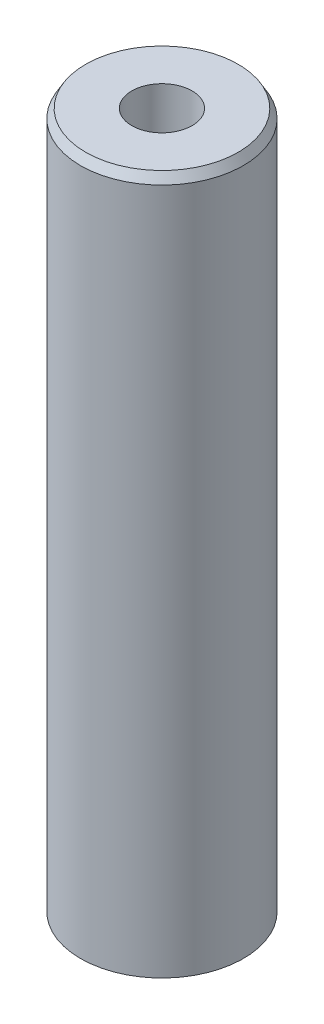
ISO-10303-21;
HEADER;
FILE_DESCRIPTION(('STEP AP214'),'2;1');
FILE_NAME('part.step','',(''),(''),'','','');
FILE_SCHEMA(('AUTOMOTIVE_DESIGN { 1 0 10303 214 1 1 1 1 }'));
ENDSEC;
DATA;
#1=APPLICATION_CONTEXT('core data for automotive mechanical design processes');
#2=APPLICATION_PROTOCOL_DEFINITION('international standard','automotive_design',2000,#1);
#3=PRODUCT_CONTEXT('',#1,'mechanical');
#4=PRODUCT('Part','Part','',(#3));
#5=PRODUCT_RELATED_PRODUCT_CATEGORY('part','',(#4));
#6=PRODUCT_DEFINITION_FORMATION('','',#4);
#7=PRODUCT_DEFINITION_CONTEXT('part definition',#1,'design');
#8=PRODUCT_DEFINITION('design','',#6,#7);
#9=PRODUCT_DEFINITION_SHAPE('','',#8);
#10=(LENGTH_UNIT() NAMED_UNIT(*) SI_UNIT(.MILLI.,.METRE.));
#11=(NAMED_UNIT(*) PLANE_ANGLE_UNIT() SI_UNIT($,.RADIAN.));
#12=(NAMED_UNIT(*) SI_UNIT($,.STERADIAN.) SOLID_ANGLE_UNIT());
#13=UNCERTAINTY_MEASURE_WITH_UNIT(LENGTH_MEASURE(1.E-05),#10,'distance_accuracy_value','');
#14=(GEOMETRIC_REPRESENTATION_CONTEXT(3) GLOBAL_UNCERTAINTY_ASSIGNED_CONTEXT((#13)) GLOBAL_UNIT_ASSIGNED_CONTEXT((#10,
#11,#12)) REPRESENTATION_CONTEXT('',''));
#15=CARTESIAN_POINT('',(0.,0.,0.));
#16=DIRECTION('',(0.,0.,1.));
#17=DIRECTION('',(1.,0.,0.));
#18=AXIS2_PLACEMENT_3D('',#15,#16,#17);
#19=CARTESIAN_POINT('',(0.,236.650991443495,0.));
#20=DIRECTION('',(0.,-1.,0.));
#21=DIRECTION('',(0.,0.,-1.));
#22=AXIS2_PLACEMENT_3D('',#19,#20,#21);
#23=CYLINDRICAL_SURFACE('',#22,27.5);
#24=CARTESIAN_POINT('',(0.,233.628504235652,0.));
#25=DIRECTION('',(0.,1.,0.));
#26=DIRECTION('',(0.,0.,1.));
#27=AXIS2_PLACEMENT_3D('',#24,#25,#26);
#28=CIRCLE('',#27,27.5);
#29=CARTESIAN_POINT('',(0.,233.628504235652,27.5));
#30=VERTEX_POINT('',#29);
#31=EDGE_CURVE('E50',#30,#30,#28,.F.);
#32=ORIENTED_EDGE('',*,*,#31,.T.);
#33=EDGE_LOOP('',(#32));
#34=FACE_BOUND('',#33,.T.);
#35=CARTESIAN_POINT('',(0.,1.74503380307023,0.));
#36=DIRECTION('',(0.,1.,0.));
#37=DIRECTION('',(0.,0.,1.));
#38=AXIS2_PLACEMENT_3D('',#35,#36,#37);
#39=CIRCLE('',#38,27.5);
#40=CARTESIAN_POINT('',(0.,1.74503380307023,27.5));
#41=VERTEX_POINT('',#40);
#42=EDGE_CURVE('E51',#41,#41,#39,.T.);
#43=ORIENTED_EDGE('',*,*,#42,.T.);
#44=EDGE_LOOP('',(#43));
#45=FACE_BOUND('',#44,.T.);
#46=ADVANCED_FACE('F39',(#34,#45),#23,.T.);
#47=CARTESIAN_POINT('',(0.,236.650991443495,0.));
#48=DIRECTION('',(0.,1.,0.));
#49=DIRECTION('',(0.,0.,1.));
#50=AXIS2_PLACEMENT_3D('',#47,#48,#49);
#51=PLANE('',#50);
#52=CARTESIAN_POINT('',(0.,236.650991443495,0.));
#53=DIRECTION('',(0.,1.,0.));
#54=DIRECTION('',(0.,0.,1.));
#55=AXIS2_PLACEMENT_3D('',#52,#53,#54);
#56=CIRCLE('',#55,25.7549661969298);
#57=CARTESIAN_POINT('',(0.,236.650991443495,25.7549661969298));
#58=VERTEX_POINT('',#57);
#59=EDGE_CURVE('E54',#58,#58,#56,.T.);
#60=ORIENTED_EDGE('',*,*,#59,.T.);
#61=EDGE_LOOP('',(#60));
#62=FACE_BOUND('',#61,.T.);
#63=CARTESIAN_POINT('',(0.,236.650991443495,0.));
#64=DIRECTION('',(0.,1.,0.));
#65=DIRECTION('',(0.,0.,1.));
#66=AXIS2_PLACEMENT_3D('',#63,#64,#65);
#67=CIRCLE('',#66,10.1835658193665);
#68=CARTESIAN_POINT('',(0.,236.650991443495,10.1835658193665));
#69=VERTEX_POINT('',#68);
#70=EDGE_CURVE('E58',#69,#69,#67,.T.);
#71=ORIENTED_EDGE('',*,*,#70,.F.);
#72=EDGE_LOOP('',(#71));
#73=FACE_BOUND('',#72,.T.);
#74=ADVANCED_FACE('F69',(#62,#73),#51,.T.);
#75=CARTESIAN_POINT('',(0.,0.,0.));
#76=DIRECTION('',(0.,1.,0.));
#77=DIRECTION('',(0.,0.,1.));
#78=AXIS2_PLACEMENT_3D('',#75,#76,#77);
#79=PLANE('',#78);
#80=CARTESIAN_POINT('',(0.,0.,0.));
#81=DIRECTION('',(0.,1.,0.));
#82=DIRECTION('',(0.,0.,1.));
#83=AXIS2_PLACEMENT_3D('',#80,#81,#82);
#84=CIRCLE('',#83,24.4775127921572);
#85=CARTESIAN_POINT('',(0.,0.,24.4775127921572));
#86=VERTEX_POINT('',#85);
#87=EDGE_CURVE('E10',#86,#86,#84,.F.);
#88=ORIENTED_EDGE('',*,*,#87,.T.);
#89=EDGE_LOOP('',(#88));
#90=FACE_BOUND('',#89,.T.);
#91=CARTESIAN_POINT('',(0.,0.,0.));
#92=DIRECTION('',(0.,1.,0.));
#93=DIRECTION('',(0.,0.,1.));
#94=AXIS2_PLACEMENT_3D('',#91,#92,#93);
#95=CIRCLE('',#94,10.1835658193665);
#96=CARTESIAN_POINT('',(0.,0.,10.1835658193665));
#97=VERTEX_POINT('',#96);
#98=EDGE_CURVE('E63',#97,#97,#95,.T.);
#99=ORIENTED_EDGE('',*,*,#98,.T.);
#100=EDGE_LOOP('',(#99));
#101=FACE_BOUND('',#100,.T.);
#102=ADVANCED_FACE('F75',(#90,#101),#79,.F.);
#103=CARTESIAN_POINT('',(0.,236.650991443495,0.));
#104=DIRECTION('',(0.,-1.,0.));
#105=DIRECTION('',(0.,0.,-1.));
#106=AXIS2_PLACEMENT_3D('',#103,#104,#105);
#107=CYLINDRICAL_SURFACE('',#106,10.1835658193665);
#108=ORIENTED_EDGE('',*,*,#70,.T.);
#109=EDGE_LOOP('',(#108));
#110=FACE_BOUND('',#109,.T.);
#111=ORIENTED_EDGE('',*,*,#98,.F.);
#112=EDGE_LOOP('',(#111));
#113=FACE_BOUND('',#112,.T.);
#114=ADVANCED_FACE('F70',(#110,#113),#107,.F.);
#115=CARTESIAN_POINT('',(0.,236.650991443495,0.));
#116=DIRECTION('',(0.,-1.,0.));
#117=DIRECTION('',(0.,0.,-1.));
#118=AXIS2_PLACEMENT_3D('',#115,#116,#117);
#119=CONICAL_SURFACE('',#118,25.7549661969298,0.523598775598296);
#120=ORIENTED_EDGE('',*,*,#31,.F.);
#121=EDGE_LOOP('',(#120));
#122=FACE_BOUND('',#121,.T.);
#123=ORIENTED_EDGE('',*,*,#59,.F.);
#124=EDGE_LOOP('',(#123));
#125=FACE_BOUND('',#124,.T.);
#126=ADVANCED_FACE('F81',(#122,#125),#119,.T.);
#127=CARTESIAN_POINT('',(0.,1.74503380307023,0.));
#128=DIRECTION('',(0.,1.,0.));
#129=DIRECTION('',(0.,0.,1.));
#130=AXIS2_PLACEMENT_3D('',#127,#128,#129);
#131=CONICAL_SURFACE('',#130,27.5,1.0471975511966);
#132=ORIENTED_EDGE('',*,*,#87,.F.);
#133=EDGE_LOOP('',(#132));
#134=FACE_BOUND('',#133,.T.);
#135=ORIENTED_EDGE('',*,*,#42,.F.);
#136=EDGE_LOOP('',(#135));
#137=FACE_BOUND('',#136,.T.);
#138=ADVANCED_FACE('F45',(#134,#137),#131,.T.);
#139=CLOSED_SHELL('',(#46,#74,#102,#114,#126,#138));
#140=MANIFOLD_SOLID_BREP('B2',#139);
#141=ADVANCED_BREP_SHAPE_REPRESENTATION('',(#18,#140),#14);
#142=SHAPE_DEFINITION_REPRESENTATION(#9,#141);
ENDSEC;
END-ISO-10303-21;
